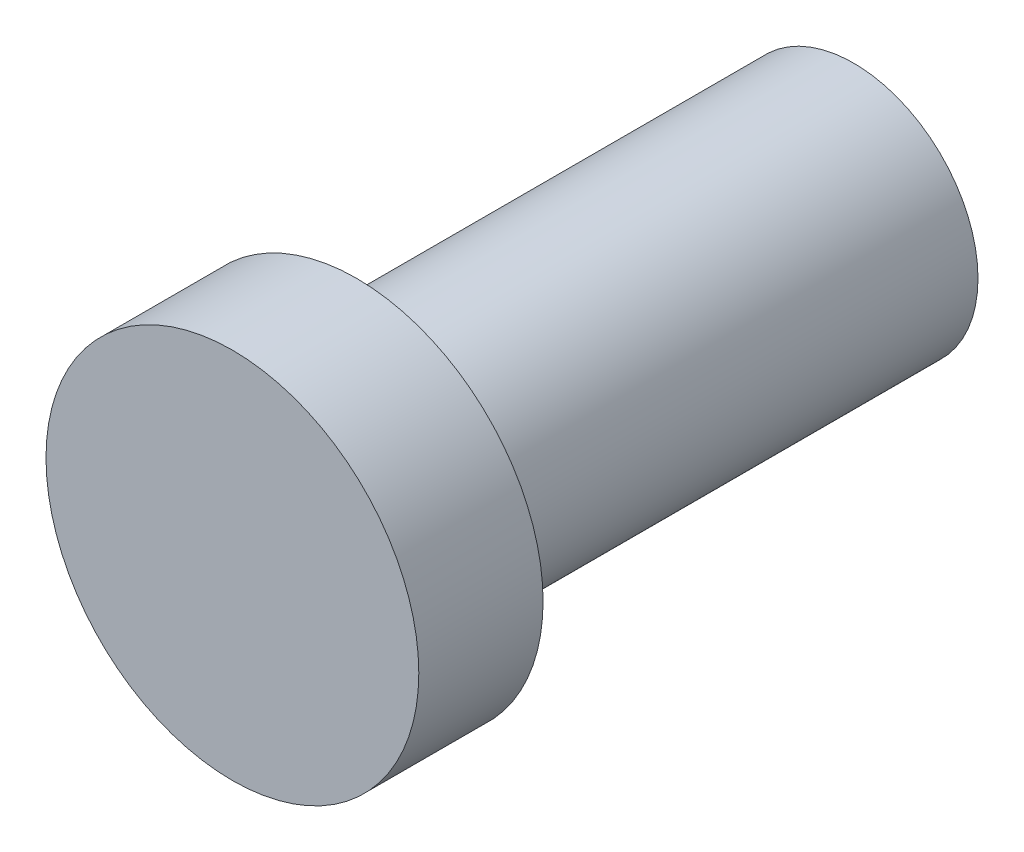
ISO-10303-21;
HEADER;
FILE_DESCRIPTION(('STEP AP214'),'2;1');
FILE_NAME('part.step','',(''),(''),'','','');
FILE_SCHEMA(('AUTOMOTIVE_DESIGN { 1 0 10303 214 1 1 1 1 }'));
ENDSEC;
DATA;
#1=APPLICATION_CONTEXT('core data for automotive mechanical design processes');
#2=APPLICATION_PROTOCOL_DEFINITION('international standard','automotive_design',2000,#1);
#3=PRODUCT_CONTEXT('',#1,'mechanical');
#4=PRODUCT('Part','Part','',(#3));
#5=PRODUCT_RELATED_PRODUCT_CATEGORY('part','',(#4));
#6=PRODUCT_DEFINITION_FORMATION('','',#4);
#7=PRODUCT_DEFINITION_CONTEXT('part definition',#1,'design');
#8=PRODUCT_DEFINITION('design','',#6,#7);
#9=PRODUCT_DEFINITION_SHAPE('','',#8);
#10=(LENGTH_UNIT() NAMED_UNIT(*) SI_UNIT(.MILLI.,.METRE.));
#11=(NAMED_UNIT(*) PLANE_ANGLE_UNIT() SI_UNIT($,.RADIAN.));
#12=(NAMED_UNIT(*) SI_UNIT($,.STERADIAN.) SOLID_ANGLE_UNIT());
#13=UNCERTAINTY_MEASURE_WITH_UNIT(LENGTH_MEASURE(1.E-05),#10,'distance_accuracy_value','');
#14=(GEOMETRIC_REPRESENTATION_CONTEXT(3) GLOBAL_UNCERTAINTY_ASSIGNED_CONTEXT((#13)) GLOBAL_UNIT_ASSIGNED_CONTEXT((#10,
#11,#12)) REPRESENTATION_CONTEXT('',''));
#15=CARTESIAN_POINT('',(0.,0.,0.));
#16=DIRECTION('',(0.,0.,1.));
#17=DIRECTION('',(1.,0.,0.));
#18=AXIS2_PLACEMENT_3D('',#15,#16,#17);
#19=CARTESIAN_POINT('',(0.,0.,25.4));
#20=DIRECTION('',(0.,0.,-1.));
#21=DIRECTION('',(-1.,0.,0.));
#22=AXIS2_PLACEMENT_3D('',#19,#20,#21);
#23=CYLINDRICAL_SURFACE('',#22,6.35);
#24=CARTESIAN_POINT('',(0.,0.,25.4));
#25=DIRECTION('',(0.,0.,1.));
#26=DIRECTION('',(1.,0.,0.));
#27=AXIS2_PLACEMENT_3D('',#24,#25,#26);
#28=CIRCLE('',#27,6.35);
#29=CARTESIAN_POINT('',(6.35,0.,25.4));
#30=VERTEX_POINT('',#29);
#31=EDGE_CURVE('E10',#30,#30,#28,.T.);
#32=ORIENTED_EDGE('',*,*,#31,.F.);
#33=EDGE_LOOP('',(#32));
#34=FACE_BOUND('',#33,.T.);
#35=CARTESIAN_POINT('',(0.,0.,0.));
#36=DIRECTION('',(0.,0.,1.));
#37=DIRECTION('',(1.,0.,0.));
#38=AXIS2_PLACEMENT_3D('',#35,#36,#37);
#39=CIRCLE('',#38,6.35);
#40=CARTESIAN_POINT('',(6.35,0.,0.));
#41=VERTEX_POINT('',#40);
#42=EDGE_CURVE('E33',#41,#41,#39,.T.);
#43=ORIENTED_EDGE('',*,*,#42,.T.);
#44=EDGE_LOOP('',(#43));
#45=FACE_BOUND('',#44,.T.);
#46=ADVANCED_FACE('F30',(#34,#45),#23,.T.);
#47=CARTESIAN_POINT('',(0.,0.,0.));
#48=DIRECTION('',(0.,0.,1.));
#49=DIRECTION('',(1.,0.,0.));
#50=AXIS2_PLACEMENT_3D('',#47,#48,#49);
#51=PLANE('',#50);
#52=ORIENTED_EDGE('',*,*,#42,.F.);
#53=EDGE_LOOP('',(#52));
#54=FACE_BOUND('',#53,.T.);
#55=ADVANCED_FACE('F53',(#54),#51,.F.);
#56=CARTESIAN_POINT('',(0.,0.,31.75));
#57=DIRECTION('',(0.,0.,-1.));
#58=DIRECTION('',(-1.,0.,0.));
#59=AXIS2_PLACEMENT_3D('',#56,#57,#58);
#60=CYLINDRICAL_SURFACE('',#59,9.525);
#61=CARTESIAN_POINT('',(0.,0.,31.75));
#62=DIRECTION('',(0.,0.,1.));
#63=DIRECTION('',(1.,0.,0.));
#64=AXIS2_PLACEMENT_3D('',#61,#62,#63);
#65=CIRCLE('',#64,9.525);
#66=CARTESIAN_POINT('',(9.525,0.,31.75));
#67=VERTEX_POINT('',#66);
#68=EDGE_CURVE('E40',#67,#67,#65,.T.);
#69=ORIENTED_EDGE('',*,*,#68,.F.);
#70=EDGE_LOOP('',(#69));
#71=FACE_BOUND('',#70,.T.);
#72=CARTESIAN_POINT('',(0.,0.,25.4));
#73=DIRECTION('',(0.,0.,1.));
#74=DIRECTION('',(1.,0.,0.));
#75=AXIS2_PLACEMENT_3D('',#72,#73,#74);
#76=CIRCLE('',#75,9.525);
#77=CARTESIAN_POINT('',(9.525,0.,25.4));
#78=VERTEX_POINT('',#77);
#79=EDGE_CURVE('E42',#78,#78,#76,.T.);
#80=ORIENTED_EDGE('',*,*,#79,.T.);
#81=EDGE_LOOP('',(#80));
#82=FACE_BOUND('',#81,.T.);
#83=ADVANCED_FACE('F50',(#71,#82),#60,.T.);
#84=CARTESIAN_POINT('',(0.,0.,31.75));
#85=DIRECTION('',(0.,0.,1.));
#86=DIRECTION('',(1.,0.,0.));
#87=AXIS2_PLACEMENT_3D('',#84,#85,#86);
#88=PLANE('',#87);
#89=ORIENTED_EDGE('',*,*,#68,.T.);
#90=EDGE_LOOP('',(#89));
#91=FACE_BOUND('',#90,.T.);
#92=ADVANCED_FACE('F48',(#91),#88,.T.);
#93=CARTESIAN_POINT('',(0.,0.,25.4));
#94=DIRECTION('',(0.,0.,1.));
#95=DIRECTION('',(1.,0.,0.));
#96=AXIS2_PLACEMENT_3D('',#93,#94,#95);
#97=PLANE('',#96);
#98=ORIENTED_EDGE('',*,*,#31,.T.);
#99=EDGE_LOOP('',(#98));
#100=FACE_BOUND('',#99,.T.);
#101=ORIENTED_EDGE('',*,*,#79,.F.);
#102=EDGE_LOOP('',(#101));
#103=FACE_BOUND('',#102,.T.);
#104=ADVANCED_FACE('F57',(#100,#103),#97,.F.);
#105=CLOSED_SHELL('',(#46,#55,#83,#92,#104));
#106=MANIFOLD_SOLID_BREP('B2',#105);
#107=ADVANCED_BREP_SHAPE_REPRESENTATION('',(#18,#106),#14);
#108=SHAPE_DEFINITION_REPRESENTATION(#9,#107);
ENDSEC;
END-ISO-10303-21;
